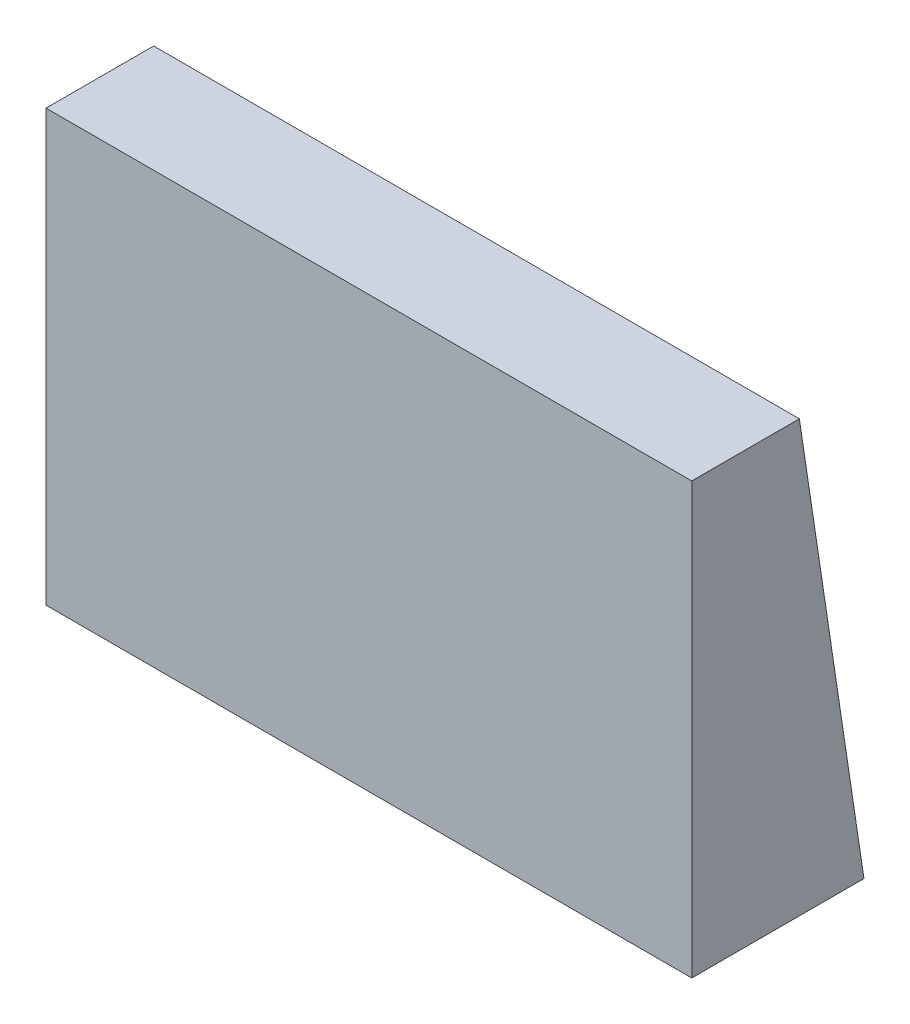
ISO-10303-21;
HEADER;
FILE_DESCRIPTION(('STEP AP214'),'2;1');
FILE_NAME('part.step','',(''),(''),'','','');
FILE_SCHEMA(('AUTOMOTIVE_DESIGN { 1 0 10303 214 1 1 1 1 }'));
ENDSEC;
DATA;
#1=APPLICATION_CONTEXT('core data for automotive mechanical design processes');
#2=APPLICATION_PROTOCOL_DEFINITION('international standard','automotive_design',2000,#1);
#3=PRODUCT_CONTEXT('',#1,'mechanical');
#4=PRODUCT('Part','Part','',(#3));
#5=PRODUCT_RELATED_PRODUCT_CATEGORY('part','',(#4));
#6=PRODUCT_DEFINITION_FORMATION('','',#4);
#7=PRODUCT_DEFINITION_CONTEXT('part definition',#1,'design');
#8=PRODUCT_DEFINITION('design','',#6,#7);
#9=PRODUCT_DEFINITION_SHAPE('','',#8);
#10=(LENGTH_UNIT() NAMED_UNIT(*) SI_UNIT(.MILLI.,.METRE.));
#11=(NAMED_UNIT(*) PLANE_ANGLE_UNIT() SI_UNIT($,.RADIAN.));
#12=(NAMED_UNIT(*) SI_UNIT($,.STERADIAN.) SOLID_ANGLE_UNIT());
#13=UNCERTAINTY_MEASURE_WITH_UNIT(LENGTH_MEASURE(1.E-05),#10,'distance_accuracy_value','');
#14=(GEOMETRIC_REPRESENTATION_CONTEXT(3) GLOBAL_UNCERTAINTY_ASSIGNED_CONTEXT((#13)) GLOBAL_UNIT_ASSIGNED_CONTEXT((#10,
#11,#12)) REPRESENTATION_CONTEXT('',''));
#15=CARTESIAN_POINT('',(0.,0.,0.));
#16=DIRECTION('',(0.,0.,1.));
#17=DIRECTION('',(1.,0.,0.));
#18=AXIS2_PLACEMENT_3D('',#15,#16,#17);
#19=CARTESIAN_POINT('',(15.,20.,-2.5));
#20=DIRECTION('',(-1.,0.,0.));
#21=DIRECTION('',(0.,0.,1.));
#22=AXIS2_PLACEMENT_3D('',#19,#20,#21);
#23=PLANE('',#22);
#24=DIRECTION('',(0.,0.,-1.));
#25=VECTOR('',#24,1.);
#26=CARTESIAN_POINT('',(15.,0.,-2.5));
#27=LINE('',#26,#25);
#28=CARTESIAN_POINT('',(15.,0.,2.5));
#29=VERTEX_POINT('',#28);
#30=CARTESIAN_POINT('',(15.,0.,-5.5));
#31=VERTEX_POINT('',#30);
#32=EDGE_CURVE('E91',#29,#31,#27,.T.);
#33=ORIENTED_EDGE('',*,*,#32,.T.);
#34=DIRECTION('',(0.,0.988936352868298,0.148340452930245));
#35=VECTOR('',#34,1.);
#36=CARTESIAN_POINT('',(15.,0.,-5.5));
#37=LINE('',#36,#35);
#38=CARTESIAN_POINT('',(15.,20.,-2.5));
#39=VERTEX_POINT('',#38);
#40=EDGE_CURVE('E94',#31,#39,#37,.T.);
#41=ORIENTED_EDGE('',*,*,#40,.T.);
#42=DIRECTION('',(0.,0.,-1.));
#43=VECTOR('',#42,1.);
#44=CARTESIAN_POINT('',(15.,20.,-2.5));
#45=LINE('',#44,#43);
#46=CARTESIAN_POINT('',(15.,20.,2.5));
#47=VERTEX_POINT('',#46);
#48=EDGE_CURVE('E79',#47,#39,#45,.T.);
#49=ORIENTED_EDGE('',*,*,#48,.F.);
#50=DIRECTION('',(0.,-1.,0.));
#51=VECTOR('',#50,1.);
#52=CARTESIAN_POINT('',(15.,20.,2.5));
#53=LINE('',#52,#51);
#54=EDGE_CURVE('E41',#47,#29,#53,.T.);
#55=ORIENTED_EDGE('',*,*,#54,.T.);
#56=EDGE_LOOP('',(#33,#41,#49,#55));
#57=FACE_BOUND('',#56,.T.);
#58=ADVANCED_FACE('F33',(#57),#23,.F.);
#59=CARTESIAN_POINT('',(-15.,20.,-2.5));
#60=DIRECTION('',(1.,0.,0.));
#61=DIRECTION('',(0.,0.,-1.));
#62=AXIS2_PLACEMENT_3D('',#59,#60,#61);
#63=PLANE('',#62);
#64=DIRECTION('',(0.,0.,1.));
#65=VECTOR('',#64,1.);
#66=CARTESIAN_POINT('',(-15.,0.,-2.5));
#67=LINE('',#66,#65);
#68=CARTESIAN_POINT('',(-15.,0.,-5.5));
#69=VERTEX_POINT('',#68);
#70=CARTESIAN_POINT('',(-15.,0.,2.5));
#71=VERTEX_POINT('',#70);
#72=EDGE_CURVE('E61',#69,#71,#67,.T.);
#73=ORIENTED_EDGE('',*,*,#72,.T.);
#74=DIRECTION('',(0.,-1.,0.));
#75=VECTOR('',#74,1.);
#76=CARTESIAN_POINT('',(-15.,20.,2.5));
#77=LINE('',#76,#75);
#78=CARTESIAN_POINT('',(-15.,20.,2.5));
#79=VERTEX_POINT('',#78);
#80=EDGE_CURVE('E11',#79,#71,#77,.T.);
#81=ORIENTED_EDGE('',*,*,#80,.F.);
#82=DIRECTION('',(0.,0.,1.));
#83=VECTOR('',#82,1.);
#84=CARTESIAN_POINT('',(-15.,20.,-2.5));
#85=LINE('',#84,#83);
#86=CARTESIAN_POINT('',(-15.,20.,-2.5));
#87=VERTEX_POINT('',#86);
#88=EDGE_CURVE('E77',#87,#79,#85,.T.);
#89=ORIENTED_EDGE('',*,*,#88,.F.);
#90=DIRECTION('',(0.,-0.988936352868298,-0.148340452930245));
#91=VECTOR('',#90,1.);
#92=CARTESIAN_POINT('',(-15.,0.,-5.5));
#93=LINE('',#92,#91);
#94=EDGE_CURVE('E86',#87,#69,#93,.T.);
#95=ORIENTED_EDGE('',*,*,#94,.T.);
#96=EDGE_LOOP('',(#73,#81,#89,#95));
#97=FACE_BOUND('',#96,.T.);
#98=ADVANCED_FACE('F85',(#97),#63,.F.);
#99=CARTESIAN_POINT('',(-15.,20.,2.5));
#100=DIRECTION('',(0.,0.,-1.));
#101=DIRECTION('',(-1.,0.,0.));
#102=AXIS2_PLACEMENT_3D('',#99,#100,#101);
#103=PLANE('',#102);
#104=DIRECTION('',(1.,0.,0.));
#105=VECTOR('',#104,1.);
#106=CARTESIAN_POINT('',(-15.,0.,2.5));
#107=LINE('',#106,#105);
#108=EDGE_CURVE('E98',#71,#29,#107,.T.);
#109=ORIENTED_EDGE('',*,*,#108,.T.);
#110=ORIENTED_EDGE('',*,*,#54,.F.);
#111=DIRECTION('',(1.,0.,0.));
#112=VECTOR('',#111,1.);
#113=CARTESIAN_POINT('',(-15.,20.,2.5));
#114=LINE('',#113,#112);
#115=EDGE_CURVE('E49',#79,#47,#114,.T.);
#116=ORIENTED_EDGE('',*,*,#115,.F.);
#117=ORIENTED_EDGE('',*,*,#80,.T.);
#118=EDGE_LOOP('',(#109,#110,#116,#117));
#119=FACE_BOUND('',#118,.T.);
#120=ADVANCED_FACE('F107',(#119),#103,.F.);
#121=CARTESIAN_POINT('',(0.,20.,0.));
#122=DIRECTION('',(0.,1.,0.));
#123=DIRECTION('',(0.,0.,1.));
#124=AXIS2_PLACEMENT_3D('',#121,#122,#123);
#125=PLANE('',#124);
#126=ORIENTED_EDGE('',*,*,#48,.T.);
#127=DIRECTION('',(-1.,0.,0.));
#128=VECTOR('',#127,1.);
#129=CARTESIAN_POINT('',(-15.,20.,-2.5));
#130=LINE('',#129,#128);
#131=EDGE_CURVE('E74',#39,#87,#130,.T.);
#132=ORIENTED_EDGE('',*,*,#131,.T.);
#133=ORIENTED_EDGE('',*,*,#88,.T.);
#134=ORIENTED_EDGE('',*,*,#115,.T.);
#135=EDGE_LOOP('',(#126,#132,#133,#134));
#136=FACE_BOUND('',#135,.T.);
#137=ADVANCED_FACE('F76',(#136),#125,.T.);
#138=CARTESIAN_POINT('',(0.,0.,0.));
#139=DIRECTION('',(0.,1.,0.));
#140=DIRECTION('',(0.,0.,1.));
#141=AXIS2_PLACEMENT_3D('',#138,#139,#140);
#142=PLANE('',#141);
#143=ORIENTED_EDGE('',*,*,#32,.F.);
#144=ORIENTED_EDGE('',*,*,#108,.F.);
#145=ORIENTED_EDGE('',*,*,#72,.F.);
#146=DIRECTION('',(1.,0.,0.));
#147=VECTOR('',#146,1.);
#148=CARTESIAN_POINT('',(-35.2237484161567,0.,-5.5));
#149=LINE('',#148,#147);
#150=EDGE_CURVE('E90',#69,#31,#149,.T.);
#151=ORIENTED_EDGE('',*,*,#150,.T.);
#152=EDGE_LOOP('',(#143,#144,#145,#151));
#153=FACE_BOUND('',#152,.T.);
#154=ADVANCED_FACE('F106',(#153),#142,.F.);
#155=CARTESIAN_POINT('',(-35.2237484161567,0.,-5.5));
#156=DIRECTION('',(0.,0.148340452930245,-0.988936352868298));
#157=DIRECTION('',(0.,0.988936352868298,0.148340452930245));
#158=AXIS2_PLACEMENT_3D('',#155,#156,#157);
#159=PLANE('',#158);
#160=ORIENTED_EDGE('',*,*,#94,.F.);
#161=ORIENTED_EDGE('',*,*,#131,.F.);
#162=ORIENTED_EDGE('',*,*,#40,.F.);
#163=ORIENTED_EDGE('',*,*,#150,.F.);
#164=EDGE_LOOP('',(#160,#161,#162,#163));
#165=FACE_BOUND('',#164,.T.);
#166=ADVANCED_FACE('F89',(#165),#159,.T.);
#167=CLOSED_SHELL('',(#58,#98,#120,#137,#154,#166));
#168=MANIFOLD_SOLID_BREP('B2',#167);
#169=ADVANCED_BREP_SHAPE_REPRESENTATION('',(#18,#168),#14);
#170=SHAPE_DEFINITION_REPRESENTATION(#9,#169);
ENDSEC;
END-ISO-10303-21;
